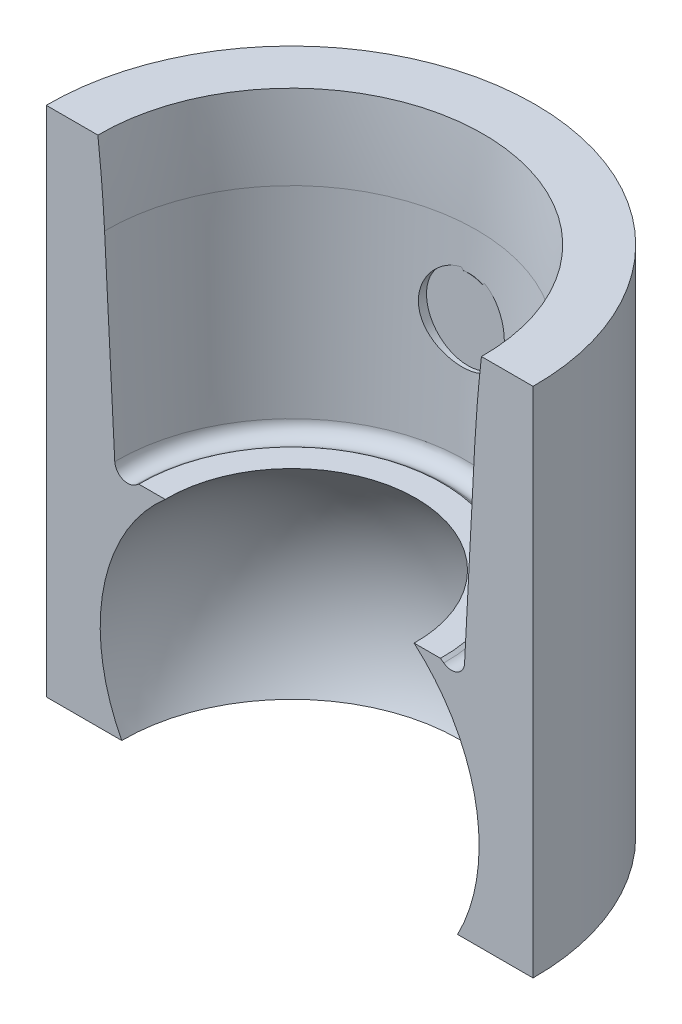
ISO-10303-21;
HEADER;
FILE_DESCRIPTION(('STEP AP214'),'2;1');
FILE_NAME('part.step','',(''),(''),'','','');
FILE_SCHEMA(('AUTOMOTIVE_DESIGN { 1 0 10303 214 1 1 1 1 }'));
ENDSEC;
DATA;
#1=APPLICATION_CONTEXT('core data for automotive mechanical design processes');
#2=APPLICATION_PROTOCOL_DEFINITION('international standard','automotive_design',2000,#1);
#3=PRODUCT_CONTEXT('',#1,'mechanical');
#4=PRODUCT('Part','Part','',(#3));
#5=PRODUCT_RELATED_PRODUCT_CATEGORY('part','',(#4));
#6=PRODUCT_DEFINITION_FORMATION('','',#4);
#7=PRODUCT_DEFINITION_CONTEXT('part definition',#1,'design');
#8=PRODUCT_DEFINITION('design','',#6,#7);
#9=PRODUCT_DEFINITION_SHAPE('','',#8);
#10=(LENGTH_UNIT() NAMED_UNIT(*) SI_UNIT(.MILLI.,.METRE.));
#11=(NAMED_UNIT(*) PLANE_ANGLE_UNIT() SI_UNIT($,.RADIAN.));
#12=(NAMED_UNIT(*) SI_UNIT($,.STERADIAN.) SOLID_ANGLE_UNIT());
#13=UNCERTAINTY_MEASURE_WITH_UNIT(LENGTH_MEASURE(1.E-05),#10,'distance_accuracy_value','');
#14=(GEOMETRIC_REPRESENTATION_CONTEXT(3) GLOBAL_UNCERTAINTY_ASSIGNED_CONTEXT((#13)) GLOBAL_UNIT_ASSIGNED_CONTEXT((#10,
#11,#12)) REPRESENTATION_CONTEXT('',''));
#15=CARTESIAN_POINT('',(0.,0.,0.));
#16=DIRECTION('',(0.,0.,1.));
#17=DIRECTION('',(1.,0.,0.));
#18=AXIS2_PLACEMENT_3D('',#15,#16,#17);
#19=CARTESIAN_POINT('',(-79.7256058125446,35.1264224483665,70.9150340188587));
#20=DIRECTION('',(0.0340598612356128,0.,0.999419794607157));
#21=DIRECTION('',(0.999419794607157,0.,-0.0340598612356128));
#22=AXIS2_PLACEMENT_3D('',#19,#20,#21);
#23=CYLINDRICAL_SURFACE('',#22,3.8862);
#24=CARTESIAN_POINT('',(-81.7677375661283,31.9086009144424,74.9691859949615));
#25=CARTESIAN_POINT('',(-81.5888086663685,31.7870084566757,74.9473227789427));
#26=CARTESIAN_POINT('',(-81.3995469542816,31.6803972746676,74.9258172586039));
#27=CARTESIAN_POINT('',(-81.0054898802874,31.500229822238,74.8858329320388));
#28=CARTESIAN_POINT('',(-80.8006851627524,31.4266936476995,74.8673559702405));
#29=CARTESIAN_POINT('',(-80.3812223129121,31.3149007902699,74.835225191827));
#30=CARTESIAN_POINT('',(-80.1665617848246,31.2766527335031,74.8215725550132));
#31=CARTESIAN_POINT('',(-79.733611100052,31.2366647347113,74.8001866517314));
#32=CARTESIAN_POINT('',(-79.5153216111935,31.2349181482583,74.7924523081928));
#33=CARTESIAN_POINT('',(-79.083170813506,31.2678314520266,74.7831919535085));
#34=CARTESIAN_POINT('',(-78.8692879243515,31.302195162723,74.7816159279515));
#35=CARTESIAN_POINT('',(-78.4501832271733,31.4058244412136,74.7839622395561));
#36=CARTESIAN_POINT('',(-78.2449619079217,31.4750919757833,74.7878848865815));
#37=CARTESIAN_POINT('',(-77.8482017405803,31.6467967664371,74.7999527797152));
#38=CARTESIAN_POINT('',(-77.656712638121,31.7493478467667,74.8081125744578));
#39=CARTESIAN_POINT('',(-77.2934252911492,31.9846750152973,74.8267916558901));
#40=CARTESIAN_POINT('',(-77.121628826949,32.1174538330008,74.8373111556551));
#41=CARTESIAN_POINT('',(-76.8004516038243,32.4114491301066,74.8586278666432));
#42=CARTESIAN_POINT('',(-76.6513723195131,32.5729950876464,74.8694269020583));
#43=CARTESIAN_POINT('',(-76.38246097456,32.9189576975818,74.8887875736911));
#44=CARTESIAN_POINT('',(-76.2626282291553,33.1033738143553,74.8973492622933));
#45=CARTESIAN_POINT('',(-76.056066776115,33.4893825740427,74.9100281066031));
#46=CARTESIAN_POINT('',(-75.9692450009104,33.6909249377274,74.9141578182541));
#47=CARTESIAN_POINT('',(-75.830909696943,34.1058058826224,74.9163450257342));
#48=CARTESIAN_POINT('',(-75.7793911508349,34.3191427829171,74.9144033846509));
#49=CARTESIAN_POINT('',(-75.7137934619049,34.7474331175279,74.9036547508926));
#50=CARTESIAN_POINT('',(-75.6990653759256,34.9622904824643,74.8949703517145));
#51=CARTESIAN_POINT('',(-75.705434496926,35.3910854219118,74.8709252589786));
#52=CARTESIAN_POINT('',(-75.7265311559046,35.6050230104424,74.8555646675473));
#53=CARTESIAN_POINT('',(-75.8035481023369,36.0253763298859,74.8191363493993));
#54=CARTESIAN_POINT('',(-75.8593701004569,36.2318115564674,74.798084825516));
#55=CARTESIAN_POINT('',(-76.003894502988,36.6323431202198,74.7518937856395));
#56=CARTESIAN_POINT('',(-76.0926013948651,36.8264377691612,74.7267537119864));
#57=CARTESIAN_POINT('',(-76.3026774468737,37.2015895083074,74.6739435475116));
#58=CARTESIAN_POINT('',(-76.4247417524266,37.3822510720483,74.6462290077816));
#59=CARTESIAN_POINT('',(-76.6972096214041,37.7208898175392,74.5913765277081));
#60=CARTESIAN_POINT('',(-76.8476171149578,37.8788638480264,74.5642386679098));
#61=CARTESIAN_POINT('',(-77.1758485894993,38.1706127982458,74.5127493140419));
#62=CARTESIAN_POINT('',(-77.3541256768495,38.3038895672149,74.4884582016627));
#63=CARTESIAN_POINT('',(-77.7311700948425,38.5386574093305,74.4459185870138));
#64=CARTESIAN_POINT('',(-77.9299355568616,38.6401513777952,74.4276695343218));
#65=CARTESIAN_POINT('',(-78.3394068335703,38.8069012249213,74.3996396446877));
#66=CARTESIAN_POINT('',(-78.5499032985727,38.872650683458,74.3897423665107));
#67=CARTESIAN_POINT('',(-78.9791692915535,38.9678196959596,74.3794438258913));
#68=CARTESIAN_POINT('',(-79.197937025862,38.99724708052,74.3790405163264));
#69=CARTESIAN_POINT('',(-79.6304435176778,39.0184001639013,74.3881429886285));
#70=CARTESIAN_POINT('',(-79.844134954855,39.0112361668352,74.3973502821376));
#71=CARTESIAN_POINT('',(-80.2668502462944,38.9620117219058,74.4248184689309));
#72=CARTESIAN_POINT('',(-80.4758743075481,38.9199528247511,74.4430789598818));
#73=CARTESIAN_POINT('',(-80.8819887658854,38.8027625881446,74.487257902345));
#74=CARTESIAN_POINT('',(-81.0791507602907,38.7278585069397,74.5131233364643));
#75=CARTESIAN_POINT('',(-81.4579520455932,38.5473481337684,74.570668446847));
#76=CARTESIAN_POINT('',(-81.6395893027354,38.4417378272101,74.6023488831752));
#77=CARTESIAN_POINT('',(-81.9871429319837,38.1998164355347,74.6700073296976));
#78=CARTESIAN_POINT('',(-82.1525566090881,38.0628077907163,74.7060725564652));
#79=CARTESIAN_POINT('',(-82.4583100591468,37.763372835557,74.7790504985755));
#80=CARTESIAN_POINT('',(-82.5986454828513,37.6009421254846,74.8159633596707));
#81=CARTESIAN_POINT('',(-82.8539473564246,37.2503957356587,74.888697952217));
#82=CARTESIAN_POINT('',(-82.9681755948624,37.061730683272,74.9244678527496));
#83=CARTESIAN_POINT('',(-83.163350075752,36.6670785096278,74.990986463391));
#84=CARTESIAN_POINT('',(-83.2442974296569,36.4610919671179,75.0217353411618));
#85=CARTESIAN_POINT('',(-83.3700387817374,36.0386192190134,75.075607335166));
#86=CARTESIAN_POINT('',(-83.4150255514756,35.8221956834957,75.0987707139994));
#87=CARTESIAN_POINT('',(-83.4679316030642,35.3841100821037,75.1359979864793));
#88=CARTESIAN_POINT('',(-83.4758584627034,35.162449096469,75.150063739847));
#89=CARTESIAN_POINT('',(-83.4544563597272,34.7262908986379,75.1681539030849));
#90=CARTESIAN_POINT('',(-83.4260851629806,34.5117566217292,75.1724284825734));
#91=CARTESIAN_POINT('',(-83.3344318669467,34.0902654762228,75.1720238761969));
#92=CARTESIAN_POINT('',(-83.2711464511165,33.8833093294725,75.1673438396182));
#93=CARTESIAN_POINT('',(-83.1121629483939,33.4846181028635,75.1503759014057));
#94=CARTESIAN_POINT('',(-83.0167385294464,33.2927708456885,75.138151532466));
#95=CARTESIAN_POINT('',(-82.7960591813308,32.927683726872,75.1080940656635));
#96=CARTESIAN_POINT('',(-82.6708208557955,32.7544335859714,75.0902640878487));
#97=CARTESIAN_POINT('',(-82.4207604654488,32.4623666526242,75.0551240384613));
#98=CARTESIAN_POINT('',(-82.300542144944,32.33950259379,75.0383803070487));
#99=CARTESIAN_POINT('',(-82.0449603339447,32.110820070039,75.0040781199892));
#100=CARTESIAN_POINT('',(-81.9095963832744,32.0050021232792,74.9865196395969));
#101=CARTESIAN_POINT('',(-81.7677375661283,31.9086009144424,74.9691859949615));
#102=B_SPLINE_CURVE_WITH_KNOTS('',3,(#24,#25,#26,#27,#28,#29,#30,#31,#32,#33,#34,#35,#36,#37,
#38,#39,#40,#41,#42,#43,#44,#45,#46,#47,#48,#49,#50,#51,#52,#53,#54,#55,#56,#57,#58,#59,#60,#61,
#62,#63,#64,#65,#66,#67,#68,#69,#70,#71,#72,#73,#74,#75,#76,#77,#78,#79,#80,#81,#82,#83,#84,#85,
#86,#87,#88,#89,#90,#91,#92,#93,#94,#95,#96,#97,#98,#99,#100,#101),.UNSPECIFIED.,.T.,.F.,(4,2,2,
2,2,2,2,2,2,2,2,2,2,2,2,2,2,2,2,2,2,2,2,2,2,2,2,2,2,2,2,2,2,2,2,2,2,2,4),(0.,0.651696577554053,
1.30378858313845,1.95603994937497,2.60817258409509,3.25499781764965,3.90185950286305,
4.55095707873766,5.20011329005073,5.85724852683873,6.5143683763378,7.16962162799851,
7.82478173481003,8.46830124499731,9.1118109115382,9.75350737377767,10.3952914340368,
11.0516310322097,11.7080617069394,12.3765576567847,13.0449926909188,13.7039466833969,
14.362758588616,15.0017009253104,15.6406148693104,16.275176206866,16.9098205455414,
17.5602323574334,18.2107568591507,18.8778707254409,19.5449623108942,20.2084534195589,
20.8718088555951,21.5180165577606,22.1642856545281,22.8051852515221,23.4457287573229,
23.9623926174669,24.4790721798746),.UNSPECIFIED.);
#103=CARTESIAN_POINT('',(-78.1662720702075,38.7362498068561,74.4115240442107));
#104=VERTEX_POINT('',#103);
#105=CARTESIAN_POINT('',(-80.0622345212644,38.9858328837169,74.4115240442107));
#106=VERTEX_POINT('',#105);
#107=EDGE_CURVE('E134',#104,#106,#102,.T.);
#108=ORIENTED_EDGE('',*,*,#107,.T.);
#109=CARTESIAN_POINT('',(-79.606446710716,35.1264224483665,74.4115240442107));
#110=DIRECTION('',(0.,0.,1.));
#111=DIRECTION('',(1.,0.,0.));
#112=AXIS2_PLACEMENT_3D('',#109,#110,#111);
#113=ELLIPSE('',#112,3.88845610320091,3.8862);
#114=EDGE_CURVE('E132',#106,#104,#113,.F.);
#115=ORIENTED_EDGE('',*,*,#114,.T.);
#116=EDGE_LOOP('',(#108,#115));
#117=FACE_BOUND('',#116,.T.);
#118=ADVANCED_FACE('F34',(#117),#23,.T.);
#119=CARTESIAN_POINT('',(-78.989108214344,1.70423955265499,92.5261108588515));
#120=DIRECTION('',(0.,1.,0.));
#121=DIRECTION('',(0.0340598612356128,0.,0.999419794607157));
#122=AXIS2_PLACEMENT_3D('',#119,#120,#121);
#123=CONICAL_SURFACE('',#122,16.1925,0.05235987755983);
#124=CARTESIAN_POINT('',(-60.638602471747,42.8990224483665,92.71));
#125=CARTESIAN_POINT('',(-60.807155535694,39.6829996001166,92.71));
#126=CARTESIAN_POINT('',(-60.9757088527177,36.4669767651306,92.71));
#127=CARTESIAN_POINT('',(-61.3128159929188,30.0349311216864,92.71));
#128=CARTESIAN_POINT('',(-61.4813698160962,26.8189083132282,92.71));
#129=CARTESIAN_POINT('',(-61.6499238923504,23.602885518034,92.71));
#130=B_SPLINE_CURVE_WITH_KNOTS('',3,(#124,#125,#126,#127,#128,#129),.UNSPECIFIED.,.F.,.F.,(4,2,
4),(0.,9.66131035949466,19.3226207189893),.UNSPECIFIED.);
#131=CARTESIAN_POINT('',(-60.6386129538292,42.8988224483665,92.71));
#132=VERTEX_POINT('',#131);
#133=CARTESIAN_POINT('',(-61.6499134102051,23.603085518034,92.71));
#134=VERTEX_POINT('',#133);
#135=EDGE_CURVE('E226',#132,#134,#130,.T.);
#136=ORIENTED_EDGE('',*,*,#135,.F.);
#137=CARTESIAN_POINT('',(-78.989108214344,42.8988224483665,92.5261108588515));
#138=DIRECTION('',(0.,-1.,0.));
#139=DIRECTION('',(-0.0340598612356128,0.,-0.999419794607157));
#140=AXIS2_PLACEMENT_3D('',#137,#138,#139);
#141=CIRCLE('',#140,18.3514166080554);
#142=CARTESIAN_POINT('',(-97.3396034748589,42.8988224483665,92.71));
#143=VERTEX_POINT('',#142);
#144=EDGE_CURVE('E178',#143,#132,#141,.T.);
#145=ORIENTED_EDGE('',*,*,#144,.F.);
#146=CARTESIAN_POINT('',(-96.3282925363377,23.602885518034,92.71));
#147=CARTESIAN_POINT('',(-96.4968466125918,26.8189083132282,92.71));
#148=CARTESIAN_POINT('',(-96.6654004357692,30.0349311216864,92.71));
#149=CARTESIAN_POINT('',(-97.0025075759703,36.4669767651306,92.71));
#150=CARTESIAN_POINT('',(-97.171060892994,39.6829996001166,92.71));
#151=CARTESIAN_POINT('',(-97.339613956941,42.8990224483665,92.71));
#152=B_SPLINE_CURVE_WITH_KNOTS('',3,(#146,#147,#148,#149,#150,#151),.UNSPECIFIED.,.F.,.F.,(4,2,
4),(0.,9.66131035949467,19.3226207189893),.UNSPECIFIED.);
#153=CARTESIAN_POINT('',(-96.328303018483,23.603085518034,92.71));
#154=VERTEX_POINT('',#153);
#155=EDGE_CURVE('E220',#154,#143,#152,.T.);
#156=ORIENTED_EDGE('',*,*,#155,.F.);
#157=CARTESIAN_POINT('',(-78.989108214344,23.603085518034,92.5261108588515));
#158=DIRECTION('',(0.,1.,0.));
#159=DIRECTION('',(0.0340598612356128,0.,0.999419794607157));
#160=AXIS2_PLACEMENT_3D('',#157,#158,#159);
#161=CIRCLE('',#160,17.3401698859069);
#162=EDGE_CURVE('E189',#134,#154,#161,.T.);
#163=ORIENTED_EDGE('',*,*,#162,.F.);
#164=EDGE_LOOP('',(#136,#145,#156,#163));
#165=FACE_BOUND('',#164,.T.);
#166=CARTESIAN_POINT('',(-80.2455281388927,39.2140607245614,74.4113240442107));
#167=CARTESIAN_POINT('',(-80.3595111780865,39.1962925564262,74.4201536633559));
#168=CARTESIAN_POINT('',(-80.4726300401191,39.1737165418166,74.4302769945168));
#169=CARTESIAN_POINT('',(-80.6963260208541,39.1192266209097,74.4528828342059));
#170=CARTESIAN_POINT('',(-80.8069037766738,39.0873150834241,74.4653647439801));
#171=CARTESIAN_POINT('',(-81.0245422211141,39.0144964180067,74.4924367688122));
#172=CARTESIAN_POINT('',(-81.1316095767474,38.9736076322145,74.5070225647035));
#173=CARTESIAN_POINT('',(-81.3417149909851,38.8831669837913,74.5380274946462));
#174=CARTESIAN_POINT('',(-81.4447528804185,38.8336147579157,74.5544467055594));
#175=CARTESIAN_POINT('',(-81.7466920166131,38.6725686547797,74.6059682550359));
#176=CARTESIAN_POINT('',(-81.938723996258,38.548582533149,74.6433736929284));
#177=CARTESIAN_POINT('',(-82.2992042309002,38.2709911214933,74.7213646017834));
#178=CARTESIAN_POINT('',(-82.4676435797755,38.1173746978887,74.7619512646767));
#179=CARTESIAN_POINT('',(-82.7807302789077,37.7802955977148,74.8441634096307));
#180=CARTESIAN_POINT('',(-82.9246849026543,37.5961878451071,74.8857897195972));
#181=CARTESIAN_POINT('',(-83.1796262495493,37.2057193089764,74.9656405556373));
#182=CARTESIAN_POINT('',(-83.2906112659191,36.999357374147,75.0038649055257));
#183=CARTESIAN_POINT('',(-83.4763443846481,36.5695087343111,75.0737616556108));
#184=CARTESIAN_POINT('',(-83.5510441696311,36.3459996519896,75.1054252875843));
#185=CARTESIAN_POINT('',(-83.6612585926114,35.8884584257408,75.1594867216038));
#186=CARTESIAN_POINT('',(-83.696784805604,35.6544294115231,75.1818872594828));
#187=CARTESIAN_POINT('',(-83.7265753587704,35.1911633489802,75.2151718000457));
#188=CARTESIAN_POINT('',(-83.7222302819936,34.9620422760097,75.2264288580766));
#189=CARTESIAN_POINT('',(-83.6754653170444,34.5074517508835,75.238384954387));
#190=CARTESIAN_POINT('',(-83.6330500586792,34.2819818580934,75.2390852763125));
#191=CARTESIAN_POINT('',(-83.5128304042838,33.8465666253052,75.2308306877923));
#192=CARTESIAN_POINT('',(-83.4358731009475,33.6363820359001,75.2221002350324));
#193=CARTESIAN_POINT('',(-83.2491304113227,33.231642100087,75.1970271041028));
#194=CARTESIAN_POINT('',(-83.1393422190349,33.0370880914013,75.1806837752071));
#195=CARTESIAN_POINT('',(-82.8881031346217,32.6657924222201,75.1424172039438));
#196=CARTESIAN_POINT('',(-82.7461864361069,32.4893747860887,75.1204111460548));
#197=CARTESIAN_POINT('',(-82.4355643076333,32.1623547685257,75.0737230991911));
#198=CARTESIAN_POINT('',(-82.2668547975494,32.0117563262279,75.0490407028338));
#199=CARTESIAN_POINT('',(-81.9023662070699,31.7366987372548,74.9991685172382));
#200=CARTESIAN_POINT('',(-81.7060003986814,31.6130153979363,74.9739820932975));
#201=CARTESIAN_POINT('',(-81.2949850822626,31.4003070167931,74.9265163624158));
#202=CARTESIAN_POINT('',(-81.0803355886942,31.311281947555,74.9042370531755));
#203=CARTESIAN_POINT('',(-80.6384657637884,31.1704948907904,74.8648114232527));
#204=CARTESIAN_POINT('',(-80.411234594738,31.1187655845092,74.8476696120832));
#205=CARTESIAN_POINT('',(-79.9509106014608,31.0544227802464,74.8200384089593));
#206=CARTESIAN_POINT('',(-79.7178184520172,31.0418047999219,74.8095482548032));
#207=CARTESIAN_POINT('',(-79.256577012534,31.0560821748752,74.79588702246));
#208=CARTESIAN_POINT('',(-79.0284105913841,31.0823156357793,74.7925956537579));
#209=CARTESIAN_POINT('',(-78.5796305885342,31.1723823126931,74.7925581505512));
#210=CARTESIAN_POINT('',(-78.3590168851193,31.2362149224758,74.7958119105186));
#211=CARTESIAN_POINT('',(-77.9325738371393,31.3992511216288,74.8075563534686));
#212=CARTESIAN_POINT('',(-77.7266828145991,31.4982953274237,74.8160235624121));
#213=CARTESIAN_POINT('',(-77.33423750307,31.7289973605775,74.8362301327875));
#214=CARTESIAN_POINT('',(-77.1476847773508,31.8606578216581,74.8479697584724));
#215=CARTESIAN_POINT('',(-76.796919188053,32.1546876695885,74.8724816852092));
#216=CARTESIAN_POINT('',(-76.6329916709436,32.3173967054734,74.8852644169875));
#217=CARTESIAN_POINT('',(-76.3346075264475,32.6680262729893,74.9091048906884));
#218=CARTESIAN_POINT('',(-76.2001516819231,32.8559474741226,74.9201625867862));
#219=CARTESIAN_POINT('',(-75.9640739256721,33.2525598316526,74.9380886555452));
#220=CARTESIAN_POINT('',(-75.8625776717784,33.4613265986617,74.9449410819785));
#221=CARTESIAN_POINT('',(-75.6961220584896,33.8930456867707,74.9523343907855));
#222=CARTESIAN_POINT('',(-75.6311580616796,34.11599620338,74.9528760744189));
#223=CARTESIAN_POINT('',(-75.5402618952524,34.5665901701096,74.9464237142159));
#224=CARTESIAN_POINT('',(-75.5138335819166,34.7941350152181,74.939527484655));
#225=CARTESIAN_POINT('',(-75.4990664291414,35.2500970870838,74.9180905078289));
#226=CARTESIAN_POINT('',(-75.5107281132079,35.478514325788,74.903549655499));
#227=CARTESIAN_POINT('',(-75.5714117583362,35.9285349375985,74.8676593654838));
#228=CARTESIAN_POINT('',(-75.6202388431702,36.1501676004288,74.8463457790042));
#229=CARTESIAN_POINT('',(-75.7534111712403,36.5818798904205,74.798492282104));
#230=CARTESIAN_POINT('',(-75.8377571886891,36.7919592656399,74.7719522577686));
#231=CARTESIAN_POINT('',(-76.0412818961589,37.1986737400192,74.7154133923176));
#232=CARTESIAN_POINT('',(-76.161047234721,37.3950073284907,74.6853619192094));
#233=CARTESIAN_POINT('',(-76.4316826266486,37.7650643583498,74.6249760240241));
#234=CARTESIAN_POINT('',(-76.5825579889913,37.9387839323532,74.5946415544979));
#235=CARTESIAN_POINT('',(-76.8354252069491,38.1849671984721,74.5500685425028));
#236=CARTESIAN_POINT('',(-76.9279253811056,38.2672150754914,74.5348515954885));
#237=CARTESIAN_POINT('',(-77.1201139390299,38.4231453483846,74.5056566927975));
#238=CARTESIAN_POINT('',(-77.2198026026188,38.4968274105312,74.4916787853992));
#239=CARTESIAN_POINT('',(-77.42577548287,38.6350953885847,74.4653844503951));
#240=CARTESIAN_POINT('',(-77.5320716613216,38.6996640721173,74.4530711722212));
#241=CARTESIAN_POINT('',(-77.7502619894614,38.8190035594535,74.4305318351189));
#242=CARTESIAN_POINT('',(-77.8621571401962,38.873772603101,74.420306151106));
#243=CARTESIAN_POINT('',(-77.9764177326349,38.9233609094516,74.4113240442107));
#244=B_SPLINE_CURVE_WITH_KNOTS('',3,(#166,#167,#168,#169,#170,#171,#172,#173,#174,#175,#176,
#177,#178,#179,#180,#181,#182,#183,#184,#185,#186,#187,#188,#189,#190,#191,#192,#193,#194,#195,
#196,#197,#198,#199,#200,#201,#202,#203,#204,#205,#206,#207,#208,#209,#210,#211,#212,#213,#214,
#215,#216,#217,#218,#219,#220,#221,#222,#223,#224,#225,#226,#227,#228,#229,#230,#231,#232,#233,
#234,#235,#236,#237,#238,#239,#240,#241,#242,#243),.UNSPECIFIED.,.F.,.F.,(4,2,2,2,2,2,2,2,2,2,2,
2,2,2,2,2,2,2,2,2,2,2,2,2,2,2,2,2,2,2,2,2,2,2,2,2,2,2,4),(0.,0.346959515303257,
0.693831068750144,1.04000038932805,1.38618422773112,2.07759055298041,2.76925718189489,
3.4780575178377,4.18689454073629,4.89667288024911,5.60624143842806,6.29115920036566,
6.97599367907493,7.64488069745541,8.31382490079602,8.99317115017407,9.67262095270809,
10.3696239831848,11.066626462357,11.764238965647,12.461771516288,13.1475564038909,
13.8333302345977,14.5160386588817,15.1988022289947,15.8895140503499,16.5802442170075,
17.2735776792657,17.966823109703,18.6510617539227,19.3353098023033,20.0159945131735,
20.6966940618209,21.3893679523025,22.0821601467103,22.4558610182903,22.8295764445186,
23.2039893197492,23.5784693775509),.UNSPECIFIED.);
#245=CARTESIAN_POINT('',(-80.2481040528897,39.2136580600531,74.4115240442107));
#246=VERTEX_POINT('',#245);
#247=CARTESIAN_POINT('',(-77.9738791180568,38.9222577921625,74.4115240442107));
#248=VERTEX_POINT('',#247);
#249=EDGE_CURVE('E137',#246,#248,#244,.T.);
#250=ORIENTED_EDGE('',*,*,#249,.F.);
#251=CARTESIAN_POINT('',(-82.8479824247615,46.1355547267881,74.4115240442107));
#252=CARTESIAN_POINT('',(-82.7563351952133,45.7716621545112,74.4115240442107));
#253=CARTESIAN_POINT('',(-82.6619548262475,45.408422504095,74.4115240442107));
#254=CARTESIAN_POINT('',(-82.4658044694869,44.6835421999464,74.4115240442107));
#255=CARTESIAN_POINT('',(-82.364026843307,44.3219036201628,74.4115240442107));
#256=CARTESIAN_POINT('',(-82.1504500448492,43.5982583155567,74.4115240442107));
#257=CARTESIAN_POINT('',(-82.038573895996,43.236273999756,74.4115240442107));
#258=CARTESIAN_POINT('',(-81.8024527631383,42.5165555324594,74.4115240442107));
#259=CARTESIAN_POINT('',(-81.6782140961791,42.1588193138006,74.4115240442107));
#260=CARTESIAN_POINT('',(-81.4054329464268,41.4311488504694,74.4115240442107));
#261=CARTESIAN_POINT('',(-81.25596225169,41.061548407396,74.4115240442107));
#262=CARTESIAN_POINT('',(-81.0083446576694,40.5171945000443,74.4115240442107));
#263=CARTESIAN_POINT('',(-80.9217815705949,40.3372006574441,74.4115240442107));
#264=CARTESIAN_POINT('',(-80.7380784850728,39.9827466612111,74.4115240442107));
#265=CARTESIAN_POINT('',(-80.6409482336772,39.8082815965455,74.4115240442107));
#266=CARTESIAN_POINT('',(-80.4327398905549,39.4701150832399,74.4115240442107));
#267=CARTESIAN_POINT('',(-80.3218009647344,39.3063281222455,74.4115240442107));
#268=CARTESIAN_POINT('',(-80.0782421902425,38.9961827791987,74.4115240442107));
#269=CARTESIAN_POINT('',(-79.9458164825699,38.8496869472483,74.4115240442107));
#270=CARTESIAN_POINT('',(-79.7446822983331,38.679038775135,74.4115240442107));
#271=CARTESIAN_POINT('',(-79.690957577923,38.6375414071897,74.4115240442107));
#272=CARTESIAN_POINT('',(-79.5787734193073,38.5612533928258,74.4115240442107));
#273=CARTESIAN_POINT('',(-79.5203097663235,38.5264688117552,74.4115240442107));
#274=CARTESIAN_POINT('',(-79.3977894232894,38.4658022083535,74.4115240442107));
#275=CARTESIAN_POINT('',(-79.33366693761,38.4400490357795,74.4115240442107));
#276=CARTESIAN_POINT('',(-79.2017035983951,38.401373646653,74.4115240442107));
#277=CARTESIAN_POINT('',(-79.1338742940759,38.3884137347989,74.4115240442107));
#278=CARTESIAN_POINT('',(-79.0041294502755,38.3779782169456,74.4115240442107));
#279=CARTESIAN_POINT('',(-78.9423336966667,38.3790305852561,74.4115240442107));
#280=CARTESIAN_POINT('',(-78.820051268791,38.3929180710014,74.4115240442107));
#281=CARTESIAN_POINT('',(-78.7595664109216,38.405768585635,74.4115240442107));
#282=CARTESIAN_POINT('',(-78.6321726838486,38.4444590824473,74.4115240442107));
#283=CARTESIAN_POINT('',(-78.5658151279899,38.4720692106852,74.4115240442107));
#284=CARTESIAN_POINT('',(-78.4383588882015,38.5374127289913,74.4115240442107));
#285=CARTESIAN_POINT('',(-78.3772691259111,38.5751628641735,74.4115240442107));
#286=CARTESIAN_POINT('',(-78.2158217515395,38.6890383061807,74.4115240442107));
#287=CARTESIAN_POINT('',(-78.1207735976982,38.7725711298843,74.4115240442107));
#288=CARTESIAN_POINT('',(-77.942882156432,38.9517192549901,74.4115240442107));
#289=CARTESIAN_POINT('',(-77.8600867962086,39.0473794196074,74.4115240442107));
#290=CARTESIAN_POINT('',(-77.6547576516487,39.3078060412454,74.4115240442107));
#291=CARTESIAN_POINT('',(-77.5397183094578,39.4784053703551,74.4115240442107));
#292=CARTESIAN_POINT('',(-77.3250975837199,39.8291988514051,74.4115240442107));
#293=CARTESIAN_POINT('',(-77.2255563338481,40.0094163433311,74.4115240442107));
#294=CARTESIAN_POINT('',(-77.0364401412549,40.3775421747923,74.4115240442107));
#295=CARTESIAN_POINT('',(-76.9469904334379,40.5655143808482,74.4115240442107));
#296=CARTESIAN_POINT('',(-76.7765467507137,40.9448905386619,74.4115240442107));
#297=CARTESIAN_POINT('',(-76.695541538777,41.1362895222664,74.4115240442107));
#298=CARTESIAN_POINT('',(-76.5220372491891,41.5660020515217,74.4115240442107));
#299=CARTESIAN_POINT('',(-76.4311826238095,41.80497636556,74.4115240442107));
#300=CARTESIAN_POINT('',(-76.256865381064,42.2856193482502,74.4115240442107));
#301=CARTESIAN_POINT('',(-76.1734039829626,42.5272884539459,74.4115240442107));
#302=CARTESIAN_POINT('',(-75.9316416138993,43.2554475028425,74.4115240442107));
#303=CARTESIAN_POINT('',(-75.7820635889811,43.7448272203344,74.4115240442107));
#304=CARTESIAN_POINT('',(-75.4982007750472,44.729673217768,74.4115240442107));
#305=CARTESIAN_POINT('',(-75.3639689127009,45.2251543983327,74.4115240442107));
#306=CARTESIAN_POINT('',(-75.1072735232405,46.2189652114649,74.4115240442107));
#307=CARTESIAN_POINT('',(-74.9848060990824,46.7172938424392,74.4115240442107));
#308=CARTESIAN_POINT('',(-74.7614223269712,47.6631325139962,74.4115240442107));
#309=CARTESIAN_POINT('',(-74.6595976227043,48.110429933355,74.4115240442107));
#310=CARTESIAN_POINT('',(-74.4618711524387,49.0063773149147,74.4115240442107));
#311=CARTESIAN_POINT('',(-74.3659700016007,49.4550274125339,74.4115240442107));
#312=CARTESIAN_POINT('',(-74.17973246323,50.3504297545002,74.4115240442107));
#313=CARTESIAN_POINT('',(-74.0893639112314,50.7971753380651,74.4115240442107));
#314=CARTESIAN_POINT('',(-73.9128467969792,51.6914276995685,74.4115240442107));
#315=CARTESIAN_POINT('',(-73.8266975745624,52.1389343470194,74.4115240442107));
#316=CARTESIAN_POINT('',(-73.7423078863117,52.5867657382959,74.4115240442107));
#317=B_SPLINE_CURVE_WITH_KNOTS('',3,(#251,#252,#253,#254,#255,#256,#257,#258,#259,#260,#261,
#262,#263,#264,#265,#266,#267,#268,#269,#270,#271,#272,#273,#274,#275,#276,#277,#278,#279,#280,
#281,#282,#283,#284,#285,#286,#287,#288,#289,#290,#291,#292,#293,#294,#295,#296,#297,#298,#299,
#300,#301,#302,#303,#304,#305,#306,#307,#308,#309,#310,#311,#312,#313,#314,#315,#316),
.UNSPECIFIED.,.F.,.F.,(4,2,2,2,2,2,2,2,2,2,2,2,2,2,2,2,2,2,2,2,2,2,2,2,2,2,2,2,2,2,2,2,4),(0.,
1.12580624044443,2.25279196936395,3.38924126228555,4.5251128014265,5.72008508454918,
6.31905899767257,6.91748503348909,7.51030583234928,8.09804144141528,8.30132158522666,
8.50478455183871,8.7110423091983,8.91669049836166,9.10092180741112,9.28539389025861,
9.49981530306578,9.71459300985278,10.0920695336193,10.4709856131211,11.0866589686954,
11.7039010571495,12.3281131914641,12.9514837935173,13.7182989338081,14.4852402999892,
16.019964409163,17.5598313217798,19.0991863720049,20.475364977316,21.8516862592673,
23.2190470018095,24.5861931169128),.UNSPECIFIED.);
#318=EDGE_CURVE('E121',#246,#106,#317,.T.);
#319=ORIENTED_EDGE('',*,*,#318,.T.);
#320=ORIENTED_EDGE('',*,*,#107,.F.);
#321=EDGE_CURVE('E142',#104,#248,#317,.T.);
#322=ORIENTED_EDGE('',*,*,#321,.T.);
#323=EDGE_LOOP('',(#250,#319,#320,#322));
#324=FACE_BOUND('',#323,.T.);
#325=ADVANCED_FACE('F151',(#165,#324),#123,.F.);
#326=CARTESIAN_POINT('',(-78.989108214344,8.70131498436996,92.5261108588516));
#327=DIRECTION('',(0.,1.,0.));
#328=DIRECTION('',(0.979687696480223,0.,0.200529342903411));
#329=AXIS2_PLACEMENT_3D('',#326,#327,#328);
#330=SPHERICAL_SURFACE('',#329,18.7833);
#331=CARTESIAN_POINT('',(-78.989108214344,0.,92.5261108588516));
#332=DIRECTION('',(0.,1.,0.));
#333=DIRECTION('',(0.,0.,1.));
#334=AXIS2_PLACEMENT_3D('',#331,#332,#333);
#335=CIRCLE('',#334,16.646305188623);
#336=CARTESIAN_POINT('',(-62.3438187540629,0.,92.71));
#337=VERTEX_POINT('',#336);
#338=CARTESIAN_POINT('',(-95.6343976746251,0.,92.71));
#339=VERTEX_POINT('',#338);
#340=EDGE_CURVE('E192',#337,#339,#335,.T.);
#341=ORIENTED_EDGE('',*,*,#340,.F.);
#342=CARTESIAN_POINT('',(-78.989108214344,8.70131498436996,92.71));
#343=DIRECTION('',(0.,0.,-1.));
#344=DIRECTION('',(-1.,0.,0.));
#345=AXIS2_PLACEMENT_3D('',#342,#343,#344);
#346=CIRCLE('',#345,18.7823998379804);
#347=CARTESIAN_POINT('',(-66.6477070660975,22.86,92.71));
#348=VERTEX_POINT('',#347);
#349=EDGE_CURVE('E219',#337,#348,#346,.F.);
#350=ORIENTED_EDGE('',*,*,#349,.T.);
#351=CARTESIAN_POINT('',(-78.989108214344,22.86,92.5261108588516));
#352=DIRECTION('',(0.,1.,0.));
#353=DIRECTION('',(0.,0.,1.));
#354=AXIS2_PLACEMENT_3D('',#351,#352,#353);
#355=CIRCLE('',#354,12.342771063184);
#356=CARTESIAN_POINT('',(-91.3305093625905,22.86,92.71));
#357=VERTEX_POINT('',#356);
#358=EDGE_CURVE('E131',#357,#348,#355,.F.);
#359=ORIENTED_EDGE('',*,*,#358,.F.);
#360=EDGE_CURVE('E49',#357,#339,#346,.F.);
#361=ORIENTED_EDGE('',*,*,#360,.T.);
#362=EDGE_LOOP('',(#341,#350,#359,#361));
#363=FACE_BOUND('',#362,.T.);
#364=ADVANCED_FACE('F279',(#363),#330,.F.);
#365=CARTESIAN_POINT('',(-78.989108214344,1.70423955265499,92.5261108588515));
#366=DIRECTION('',(-0.651237455569875,0.,-0.758874018835061));
#367=DIRECTION('',(-0.758874018835061,0.,0.651237455569875));
#368=AXIS2_PLACEMENT_3D('',#365,#366,#367);
#369=SPHERICAL_SURFACE('',#368,25.908);
#370=CARTESIAN_POINT('',(-78.989108214344,22.6248509460799,92.5261108588515));
#371=DIRECTION('',(0.,-1.,0.));
#372=DIRECTION('',(-0.0340598612356128,0.,-0.999419794607157));
#373=AXIS2_PLACEMENT_3D('',#370,#371,#372);
#374=CIRCLE('',#373,15.2824239872246);
#375=CARTESIAN_POINT('',(-94.2704258181721,22.6248509460799,92.71));
#376=VERTEX_POINT('',#375);
#377=CARTESIAN_POINT('',(-63.7077906105159,22.6248509460799,92.71));
#378=VERTEX_POINT('',#377);
#379=EDGE_CURVE('E128',#376,#378,#374,.T.);
#380=ORIENTED_EDGE('',*,*,#379,.F.);
#381=CARTESIAN_POINT('',(-78.989108214344,1.70423955265499,92.71));
#382=DIRECTION('',(0.,0.,-1.));
#383=DIRECTION('',(-1.,0.,0.));
#384=AXIS2_PLACEMENT_3D('',#381,#382,#383);
#385=CIRCLE('',#384,25.9073473899542);
#386=CARTESIAN_POINT('',(-93.9431862092697,22.86,92.71));
#387=VERTEX_POINT('',#386);
#388=EDGE_CURVE('E115',#376,#387,#385,.T.);
#389=ORIENTED_EDGE('',*,*,#388,.T.);
#390=CARTESIAN_POINT('',(-78.989108214344,22.86,92.5261108588515));
#391=DIRECTION('',(0.,1.,0.));
#392=DIRECTION('',(0.,0.,1.));
#393=AXIS2_PLACEMENT_3D('',#390,#391,#392);
#394=CIRCLE('',#393,14.9552085874638);
#395=CARTESIAN_POINT('',(-64.0350302194184,22.86,92.71));
#396=VERTEX_POINT('',#395);
#397=EDGE_CURVE('E126',#396,#387,#394,.T.);
#398=ORIENTED_EDGE('',*,*,#397,.F.);
#399=EDGE_CURVE('E56',#396,#378,#385,.T.);
#400=ORIENTED_EDGE('',*,*,#399,.T.);
#401=EDGE_LOOP('',(#380,#389,#398,#400));
#402=FACE_BOUND('',#401,.T.);
#403=ADVANCED_FACE('F125',(#402),#369,.T.);
#404=CARTESIAN_POINT('',(-78.989108214343,50.8,92.5261108588505));
#405=DIRECTION('',(0.,-1.,0.));
#406=DIRECTION('',(0.,0.,-1.));
#407=AXIS2_PLACEMENT_3D('',#404,#405,#406);
#408=CYLINDRICAL_SURFACE('',#407,24.13);
#409=CARTESIAN_POINT('',(-78.989108214343,50.8,92.5261108588505));
#410=DIRECTION('',(0.,1.,0.));
#411=DIRECTION('',(0.,0.,1.));
#412=AXIS2_PLACEMENT_3D('',#409,#410,#411);
#413=CIRCLE('',#412,24.13);
#414=CARTESIAN_POINT('',(-54.8598089127933,50.8,92.71));
#415=VERTEX_POINT('',#414);
#416=CARTESIAN_POINT('',(-103.118407515893,50.8,92.71));
#417=VERTEX_POINT('',#416);
#418=EDGE_CURVE('E150',#415,#417,#413,.T.);
#419=ORIENTED_EDGE('',*,*,#418,.F.);
#420=DIRECTION('',(0.,-1.,0.));
#421=VECTOR('',#420,1.);
#422=CARTESIAN_POINT('',(-54.8598089127933,50.8,92.71));
#423=LINE('',#422,#421);
#424=CARTESIAN_POINT('',(-54.8598089127933,0.,92.71));
#425=VERTEX_POINT('',#424);
#426=EDGE_CURVE('E228',#415,#425,#423,.T.);
#427=ORIENTED_EDGE('',*,*,#426,.T.);
#428=CARTESIAN_POINT('',(-78.989108214343,0.,92.5261108588505));
#429=DIRECTION('',(0.,1.,0.));
#430=DIRECTION('',(0.,0.,1.));
#431=AXIS2_PLACEMENT_3D('',#428,#429,#430);
#432=CIRCLE('',#431,24.13);
#433=CARTESIAN_POINT('',(-103.118407515893,0.,92.71));
#434=VERTEX_POINT('',#433);
#435=EDGE_CURVE('E195',#425,#434,#432,.T.);
#436=ORIENTED_EDGE('',*,*,#435,.T.);
#437=DIRECTION('',(0.,-1.,0.));
#438=VECTOR('',#437,1.);
#439=CARTESIAN_POINT('',(-103.118407515893,50.8,92.71));
#440=LINE('',#439,#438);
#441=EDGE_CURVE('E293',#434,#417,#440,.F.);
#442=ORIENTED_EDGE('',*,*,#441,.T.);
#443=EDGE_LOOP('',(#419,#427,#436,#442));
#444=FACE_BOUND('',#443,.T.);
#445=ADVANCED_FACE('F36',(#444),#408,.T.);
#446=CARTESIAN_POINT('',(-78.989108214343,50.8,92.5261108588505));
#447=DIRECTION('',(0.,1.,0.));
#448=DIRECTION('',(0.,0.,1.));
#449=AXIS2_PLACEMENT_3D('',#446,#447,#448);
#450=PLANE('',#449);
#451=DIRECTION('',(-1.,0.,0.));
#452=VECTOR('',#451,1.);
#453=CARTESIAN_POINT('',(-78.989108214343,50.8,92.71));
#454=LINE('',#453,#452);
#455=CARTESIAN_POINT('',(-59.9771195175855,50.8,92.71));
#456=VERTEX_POINT('',#455);
#457=EDGE_CURVE('E214',#415,#456,#454,.T.);
#458=ORIENTED_EDGE('',*,*,#457,.F.);
#459=ORIENTED_EDGE('',*,*,#418,.T.);
#460=CARTESIAN_POINT('',(-98.0010969111025,50.8,92.71));
#461=VERTEX_POINT('',#460);
#462=EDGE_CURVE('E216',#461,#417,#454,.T.);
#463=ORIENTED_EDGE('',*,*,#462,.F.);
#464=CARTESIAN_POINT('',(-78.989108214344,50.8,92.5261108588515));
#465=DIRECTION('',(0.,-1.,0.));
#466=DIRECTION('',(0.,0.,-1.));
#467=AXIS2_PLACEMENT_3D('',#464,#465,#466);
#468=CIRCLE('',#467,19.0128779889291);
#469=EDGE_CURVE('E140',#456,#461,#468,.F.);
#470=ORIENTED_EDGE('',*,*,#469,.F.);
#471=EDGE_LOOP('',(#458,#459,#463,#470));
#472=FACE_BOUND('',#471,.T.);
#473=ADVANCED_FACE('F213',(#472),#450,.T.);
#474=CARTESIAN_POINT('',(-78.989108214343,0.,92.5261108588505));
#475=DIRECTION('',(0.,1.,0.));
#476=DIRECTION('',(0.,0.,1.));
#477=AXIS2_PLACEMENT_3D('',#474,#475,#476);
#478=PLANE('',#477);
#479=ORIENTED_EDGE('',*,*,#435,.F.);
#480=DIRECTION('',(-1.,0.,0.));
#481=VECTOR('',#480,1.);
#482=CARTESIAN_POINT('',(-78.989108214343,0.,92.71));
#483=LINE('',#482,#481);
#484=EDGE_CURVE('E272',#425,#337,#483,.T.);
#485=ORIENTED_EDGE('',*,*,#484,.T.);
#486=ORIENTED_EDGE('',*,*,#340,.T.);
#487=EDGE_CURVE('E290',#339,#434,#483,.T.);
#488=ORIENTED_EDGE('',*,*,#487,.T.);
#489=EDGE_LOOP('',(#479,#485,#486,#488));
#490=FACE_BOUND('',#489,.T.);
#491=ADVANCED_FACE('F277',(#490),#478,.F.);
#492=CARTESIAN_POINT('',(-78.989108214344,23.6708815157511,92.5261108588515));
#493=DIRECTION('',(0.,-1.,0.));
#494=DIRECTION('',(-0.0340598612356128,0.,-0.999419794607157));
#495=AXIS2_PLACEMENT_3D('',#492,#493,#494);
#496=TOROIDAL_SURFACE('',#495,16.0465451865858,1.2954);
#497=ORIENTED_EDGE('',*,*,#379,.T.);
#498=CARTESIAN_POINT('',(-64.2390943477516,23.6646657181481,92.71));
#499=CARTESIAN_POINT('',(-64.2389192280619,23.6282233296773,92.71));
#500=CARTESIAN_POINT('',(-64.2372057667065,23.5918057841473,92.71));
#501=CARTESIAN_POINT('',(-64.2307190733665,23.5192460339024,92.71));
#502=CARTESIAN_POINT('',(-64.2259459884075,23.4831038160416,92.71));
#503=CARTESIAN_POINT('',(-64.2070825445942,23.3755381152224,92.71));
#504=CARTESIAN_POINT('',(-64.1884473136676,23.3048576293196,92.71));
#505=CARTESIAN_POINT('',(-64.1395759122231,23.167631765365,92.71));
#506=CARTESIAN_POINT('',(-64.1093343703128,23.1010883185257,92.71));
#507=CARTESIAN_POINT('',(-64.0381131045533,22.9740260277656,92.71));
#508=CARTESIAN_POINT('',(-63.9971354834647,22.9135060073002,92.71));
#509=CARTESIAN_POINT('',(-63.9056008559772,22.8002023730253,92.71));
#510=CARTESIAN_POINT('',(-63.8550432884465,22.7474192127128,92.71));
#511=CARTESIAN_POINT('',(-63.7457768266046,22.651080394338,92.71));
#512=CARTESIAN_POINT('',(-63.6870666897797,22.607526145393,92.71));
#513=CARTESIAN_POINT('',(-63.5631660844684,22.5308911887522,92.71));
#514=CARTESIAN_POINT('',(-63.4979754340767,22.4978107751618,92.71));
#515=CARTESIAN_POINT('',(-63.3629701249376,22.4430653853827,92.71));
#516=CARTESIAN_POINT('',(-63.2931557605538,22.4213996832742,92.71));
#517=CARTESIAN_POINT('',(-63.1508750930544,22.3900940505098,92.71));
#518=CARTESIAN_POINT('',(-63.0784085797268,22.3804550752393,92.71));
#519=CARTESIAN_POINT('',(-62.9328841769224,22.3734795314395,92.71));
#520=CARTESIAN_POINT('',(-62.8598262739137,22.3761432452158,92.71));
#521=CARTESIAN_POINT('',(-62.7151939092819,22.3936982873233,92.71));
#522=CARTESIAN_POINT('',(-62.6436194617882,22.4085897320634,92.71));
#523=CARTESIAN_POINT('',(-62.5039867453402,22.450177848056,92.71));
#524=CARTESIAN_POINT('',(-62.4359284699409,22.4768744976687,92.71));
#525=CARTESIAN_POINT('',(-62.3052597803993,22.5413155115847,92.71));
#526=CARTESIAN_POINT('',(-62.2426493989771,22.5790599422354,92.71));
#527=CARTESIAN_POINT('',(-62.1246580139545,22.6645231248358,92.71));
#528=CARTESIAN_POINT('',(-62.0692766036597,22.7122413152788,92.71));
#529=CARTESIAN_POINT('',(-61.9673216195231,22.8162872679661,92.71));
#530=CARTESIAN_POINT('',(-61.9207463164947,22.8726133360122,92.71));
#531=CARTESIAN_POINT('',(-61.8376974998819,22.9923093282272,92.71));
#532=CARTESIAN_POINT('',(-61.8012274846064,23.0556816811087,92.71));
#533=CARTESIAN_POINT('',(-61.7394292456815,23.1876751266634,92.71));
#534=CARTESIAN_POINT('',(-61.7141075874862,23.2562992843656,92.71));
#535=CARTESIAN_POINT('',(-61.6753867390491,23.3967663368511,92.71));
#536=CARTESIAN_POINT('',(-61.6619681061887,23.468603780586,92.71));
#537=CARTESIAN_POINT('',(-61.6525955647214,23.5615274027449,92.71));
#538=CARTESIAN_POINT('',(-61.6510154628957,23.5821412909297,92.71));
#539=CARTESIAN_POINT('',(-61.6488450394993,23.6233885902056,92.71));
#540=CARTESIAN_POINT('',(-61.6482531634098,23.6440219194528,92.71));
#541=CARTESIAN_POINT('',(-61.6481529234476,23.6646657181481,92.71));
#542=B_SPLINE_CURVE_WITH_KNOTS('',3,(#498,#499,#500,#501,#502,#503,#504,#505,#506,#507,#508,
#509,#510,#511,#512,#513,#514,#515,#516,#517,#518,#519,#520,#521,#522,#523,#524,#525,#526,#527,
#528,#529,#530,#531,#532,#533,#534,#535,#536,#537,#538,#539,#540,#541),.UNSPECIFIED.,.F.,.F.,(4,
2,2,2,2,2,2,2,2,2,2,2,2,2,2,2,2,2,2,2,2,4),(0.,0.109261272553491,0.21851729511397,
0.436679971557643,0.654943735519275,0.873164782414327,1.0913986152545,1.30966574517887,
1.5279390035058,1.7461983790453,1.96447509168139,2.18275681306296,2.40104061252534,
2.61932401186068,2.83760872212242,3.0558811466143,3.27411066603173,3.49241563932461,
3.71084900466001,3.92892491643986,3.99093257040921,4.05284259163128),.UNSPECIFIED.);
#543=EDGE_CURVE('E266',#378,#134,#542,.T.);
#544=ORIENTED_EDGE('',*,*,#543,.T.);
#545=ORIENTED_EDGE('',*,*,#162,.T.);
#546=CARTESIAN_POINT('',(-96.3300635052404,23.6646657181481,92.71));
#547=CARTESIAN_POINT('',(-96.3298883863897,23.6282228543795,92.71));
#548=CARTESIAN_POINT('',(-96.328174920108,23.5918048333385,92.71));
#549=CARTESIAN_POINT('',(-96.3216881996714,23.5192441289254,92.71));
#550=CARTESIAN_POINT('',(-96.3169150923479,23.4831014324246,92.71));
#551=CARTESIAN_POINT('',(-96.2980515371335,23.375534238253,92.71));
#552=CARTESIAN_POINT('',(-96.2794161732486,23.3048527374089,92.71));
#553=CARTESIAN_POINT('',(-96.2305442980126,23.1676248657296,92.71));
#554=CARTESIAN_POINT('',(-96.2003024115486,23.1010804274315,92.71));
#555=CARTESIAN_POINT('',(-96.1290801613896,22.9740163291318,92.71));
#556=CARTESIAN_POINT('',(-96.088101903354,22.913495490966,92.71));
#557=CARTESIAN_POINT('',(-95.996566231399,22.800191250301,92.71));
#558=CARTESIAN_POINT('',(-95.946008376127,22.7474082044971,92.71));
#559=CARTESIAN_POINT('',(-95.8367412165729,22.6510698557704,92.71));
#560=CARTESIAN_POINT('',(-95.7780306703519,22.6075159613269,92.71));
#561=CARTESIAN_POINT('',(-95.6541303131299,22.5308827300367,92.71));
#562=CARTESIAN_POINT('',(-95.5889404379712,22.4978034969227,92.71));
#563=CARTESIAN_POINT('',(-95.453936859287,22.4430603586661,92.71));
#564=CARTESIAN_POINT('',(-95.3841234502894,22.4213957271778,92.71));
#565=CARTESIAN_POINT('',(-95.2418450427428,22.390092053268,92.71));
#566=CARTESIAN_POINT('',(-95.1693798403247,22.3804539374489,92.71));
#567=CARTESIAN_POINT('',(-95.0238581801697,22.3734796799792,92.71));
#568=CARTESIAN_POINT('',(-94.9508017088542,22.3761438216573,92.71));
#569=CARTESIAN_POINT('',(-94.8061710772688,22.3936992845386,92.71));
#570=CARTESIAN_POINT('',(-94.7345969540464,22.4085909109597,92.71));
#571=CARTESIAN_POINT('',(-94.5949648190085,22.450179099776,92.71));
#572=CARTESIAN_POINT('',(-94.5269068011788,22.4768756419787,92.71));
#573=CARTESIAN_POINT('',(-94.3962372111997,22.5413167456986,92.71));
#574=CARTESIAN_POINT('',(-94.3336257744539,22.5790615817775,92.71));
#575=CARTESIAN_POINT('',(-94.2156323146535,22.6645256973162,92.71));
#576=CARTESIAN_POINT('',(-94.160249885211,22.712244415689,92.71));
#577=CARTESIAN_POINT('',(-94.0582927254138,22.816291838447,92.71));
#578=CARTESIAN_POINT('',(-94.0117163070074,22.872618888923,92.71));
#579=CARTESIAN_POINT('',(-93.9286655938014,22.9923171140129,92.71));
#580=CARTESIAN_POINT('',(-93.8921947969505,23.055690717103,92.71));
#581=CARTESIAN_POINT('',(-93.8303959394366,23.1876859676714,92.71));
#582=CARTESIAN_POINT('',(-93.8050742888612,23.2563106076378,92.71));
#583=CARTESIAN_POINT('',(-93.7663537978256,23.3967786574794,92.71));
#584=CARTESIAN_POINT('',(-93.752935511065,23.4686166153433,92.71));
#585=CARTESIAN_POINT('',(-93.7435639125828,23.5615385084575,92.71));
#586=CARTESIAN_POINT('',(-93.7419841071761,23.5821501806979,92.71));
#587=CARTESIAN_POINT('',(-93.7398140840894,23.6233930398835,92.71));
#588=CARTESIAN_POINT('',(-93.7392223123077,23.6440241450129,92.71));
#589=CARTESIAN_POINT('',(-93.7391220809364,23.6646657181481,92.71));
#590=B_SPLINE_CURVE_WITH_KNOTS('',3,(#546,#547,#548,#549,#550,#551,#552,#553,#554,#555,#556,
#557,#558,#559,#560,#561,#562,#563,#564,#565,#566,#567,#568,#569,#570,#571,#572,#573,#574,#575,
#576,#577,#578,#579,#580,#581,#582,#583,#584,#585,#586,#587,#588,#589),.UNSPECIFIED.,.F.,.F.,(4,
2,2,2,2,2,2,2,2,2,2,2,2,2,2,2,2,2,2,2,2,4),(0.,0.109262698550887,0.218520154001471,
0.436685865592488,0.654952734366898,0.87317682778565,1.09141097769896,1.30967840881997,
1.52794800141986,1.7462037031834,1.96447621977178,2.18275376333766,2.40103675563213,
2.61931937455035,2.83760741848149,3.05588318578232,3.27411706860499,3.49242639656603,
3.71086107586707,3.92893824186889,3.99093920507893,4.05284255329879),.UNSPECIFIED.);
#591=EDGE_CURVE('E246',#154,#376,#590,.T.);
#592=ORIENTED_EDGE('',*,*,#591,.T.);
#593=EDGE_LOOP('',(#497,#544,#545,#592));
#594=FACE_BOUND('',#593,.T.);
#595=ADVANCED_FACE('F273',(#594),#496,.F.);
#596=CARTESIAN_POINT('',(-60.648339197171,42.8988224483665,91.9010641557042));
#597=CARTESIAN_POINT('',(-60.1428608209945,52.166399410317,91.8838376374352));
#598=CARTESIAN_POINT('',(-58.3931600271572,61.2374815157511,91.8242084740311));
#599=B_SPLINE_CURVE_WITH_KNOTS('',2,(#596,#597,#598),.UNSPECIFIED.,.F.,.F.,(3,3),(0.,1.),.UNSPECIFIED.);
#600=CARTESIAN_POINT('',(-78.989108214344,22.3754815157511,92.5261108588515));
#601=DIRECTION('',(0.,-1.,0.));
#602=AXIS1_PLACEMENT('',#600,#601);
#603=SURFACE_OF_REVOLUTION('',#599,#602);
#604=ORIENTED_EDGE('',*,*,#469,.T.);
#605=CARTESIAN_POINT('',(-98.0010969111025,50.8,92.71));
#606=CARTESIAN_POINT('',(-97.9639466086404,50.4716195058704,92.71));
#607=CARTESIAN_POINT('',(-97.9279963605315,50.1431032703552,92.71));
#608=CARTESIAN_POINT('',(-97.8585005075888,49.4858693056696,92.71));
#609=CARTESIAN_POINT('',(-97.8249545217732,49.1571516167848,92.71));
#610=CARTESIAN_POINT('',(-97.7602633440703,48.4995151401832,92.71));
#611=CARTESIAN_POINT('',(-97.729117899076,48.1705963773634,92.71));
#612=CARTESIAN_POINT('',(-97.6692238247328,47.5125581433946,92.71));
#613=CARTESIAN_POINT('',(-97.6404750694713,47.1834386837057,92.71));
#614=CARTESIAN_POINT('',(-97.5853704678961,46.5249997214774,92.71));
#615=CARTESIAN_POINT('',(-97.5590146200717,46.1956802190645,92.71));
#616=CARTESIAN_POINT('',(-97.5086918576945,45.5368411677671,92.71));
#617=CARTESIAN_POINT('',(-97.4847250700135,45.2073216091925,92.71));
#618=CARTESIAN_POINT('',(-97.4391765295818,44.5480827217699,92.71));
#619=CARTESIAN_POINT('',(-97.417595029143,44.2183633754908,92.71));
#620=CARTESIAN_POINT('',(-97.3768130457071,43.5587251655711,92.71));
#621=CARTESIAN_POINT('',(-97.3576129394424,43.2288062786383,92.71));
#622=CARTESIAN_POINT('',(-97.3396034748589,42.8988224483665,92.71));
#623=B_SPLINE_CURVE_WITH_KNOTS('',3,(#605,#606,#607,#608,#609,#610,#611,#612,#613,#614,#615,
#616,#617,#618,#619,#620,#621,#622),.UNSPECIFIED.,.F.,.F.,(4,2,2,2,2,2,2,2,4),(0.,
0.991423523574362,1.98268959627144,2.97385100900585,3.96496031721164,4.9560689997249,
5.94723028736075,6.93849631832639,7.92991896638401),.UNSPECIFIED.);
#624=EDGE_CURVE('E207',#461,#143,#623,.T.);
#625=ORIENTED_EDGE('',*,*,#624,.T.);
#626=ORIENTED_EDGE('',*,*,#144,.T.);
#627=CARTESIAN_POINT('',(-60.6386129538292,42.8988224483665,92.71));
#628=CARTESIAN_POINT('',(-60.6206034892456,43.2288062786383,92.71));
#629=CARTESIAN_POINT('',(-60.6014033829809,43.5587251655711,92.71));
#630=CARTESIAN_POINT('',(-60.5606213995451,44.2183633754908,92.71));
#631=CARTESIAN_POINT('',(-60.5390398991063,44.5480827217699,92.71));
#632=CARTESIAN_POINT('',(-60.4934913586746,45.2073216091925,92.71));
#633=CARTESIAN_POINT('',(-60.4695245709936,45.5368411677671,92.71));
#634=CARTESIAN_POINT('',(-60.4192018086164,46.1956802190645,92.71));
#635=CARTESIAN_POINT('',(-60.392845960792,46.5249997214774,92.71));
#636=CARTESIAN_POINT('',(-60.3377413592167,47.1834386837057,92.71));
#637=CARTESIAN_POINT('',(-60.3089926039552,47.5125581433946,92.71));
#638=CARTESIAN_POINT('',(-60.249098529612,48.1705963773634,92.71));
#639=CARTESIAN_POINT('',(-60.2179530846177,48.4995151401832,92.71));
#640=CARTESIAN_POINT('',(-60.1532619069148,49.1571516167848,92.71));
#641=CARTESIAN_POINT('',(-60.1197159210993,49.4858693056696,92.71));
#642=CARTESIAN_POINT('',(-60.0502200681565,50.1431032703552,92.71));
#643=CARTESIAN_POINT('',(-60.0142698200476,50.4716195058704,92.71));
#644=CARTESIAN_POINT('',(-59.9771195175855,50.8,92.7100000000001));
#645=B_SPLINE_CURVE_WITH_KNOTS('',3,(#627,#628,#629,#630,#631,#632,#633,#634,#635,#636,#637,
#638,#639,#640,#641,#642,#643,#644),.UNSPECIFIED.,.F.,.F.,(4,2,2,2,2,2,2,2,4),(0.,
0.991422648057626,1.98268867902326,2.97384996665912,3.96495864917237,4.95606795737817,
5.94722937011258,6.93849544280965,7.92991896638402),.UNSPECIFIED.);
#646=EDGE_CURVE('E209',#132,#456,#645,.T.);
#647=ORIENTED_EDGE('',*,*,#646,.T.);
#648=EDGE_LOOP('',(#604,#625,#626,#647));
#649=FACE_BOUND('',#648,.T.);
#650=ADVANCED_FACE('F166',(#649),#603,.T.);
#651=CARTESIAN_POINT('',(-78.989108214344,22.86,92.5261108588515));
#652=DIRECTION('',(0.,1.,0.));
#653=DIRECTION('',(0.,0.,1.));
#654=AXIS2_PLACEMENT_3D('',#651,#652,#653);
#655=PLANE('',#654);
#656=DIRECTION('',(-1.,0.,0.));
#657=VECTOR('',#656,1.);
#658=CARTESIAN_POINT('',(-78.989108214344,22.86,92.71));
#659=LINE('',#658,#657);
#660=EDGE_CURVE('E12',#396,#348,#659,.T.);
#661=ORIENTED_EDGE('',*,*,#660,.F.);
#662=ORIENTED_EDGE('',*,*,#397,.T.);
#663=EDGE_CURVE('E38',#357,#387,#659,.T.);
#664=ORIENTED_EDGE('',*,*,#663,.F.);
#665=ORIENTED_EDGE('',*,*,#358,.T.);
#666=EDGE_LOOP('',(#661,#662,#664,#665));
#667=FACE_BOUND('',#666,.T.);
#668=ADVANCED_FACE('F130',(#667),#655,.T.);
#669=CARTESIAN_POINT('',(-79.6123535129301,35.155093311905,74.4115240442107));
#670=DIRECTION('',(0.,0.,1.));
#671=DIRECTION('',(1.,0.,0.));
#672=AXIS2_PLACEMENT_3D('',#669,#670,#671);
#673=CYLINDRICAL_SURFACE('',#672,4.1080563);
#674=ORIENTED_EDGE('',*,*,#249,.T.);
#675=CARTESIAN_POINT('',(-79.6123535129301,35.155093311905,74.4115240442107));
#676=DIRECTION('',(0.,0.,1.));
#677=DIRECTION('',(1.,0.,0.));
#678=AXIS2_PLACEMENT_3D('',#675,#676,#677);
#679=CIRCLE('',#678,4.1080563);
#680=EDGE_CURVE('E223',#246,#248,#679,.T.);
#681=ORIENTED_EDGE('',*,*,#680,.F.);
#682=EDGE_LOOP('',(#674,#681));
#683=FACE_BOUND('',#682,.T.);
#684=ADVANCED_FACE('F160',(#683),#673,.F.);
#685=CARTESIAN_POINT('',(0.,0.,74.4115240442107));
#686=DIRECTION('',(0.,0.,1.));
#687=DIRECTION('',(1.,0.,0.));
#688=AXIS2_PLACEMENT_3D('',#685,#686,#687);
#689=PLANE('',#688);
#690=ORIENTED_EDGE('',*,*,#680,.T.);
#691=ORIENTED_EDGE('',*,*,#321,.F.);
#692=ORIENTED_EDGE('',*,*,#114,.F.);
#693=ORIENTED_EDGE('',*,*,#318,.F.);
#694=EDGE_LOOP('',(#690,#691,#692,#693));
#695=FACE_BOUND('',#694,.T.);
#696=ADVANCED_FACE('F155',(#695),#689,.T.);
#697=CARTESIAN_POINT('',(0.,0.,92.71));
#698=DIRECTION('',(0.,0.,-1.));
#699=DIRECTION('',(-1.,0.,0.));
#700=AXIS2_PLACEMENT_3D('',#697,#698,#699);
#701=PLANE('',#700);
#702=ORIENTED_EDGE('',*,*,#462,.T.);
#703=ORIENTED_EDGE('',*,*,#441,.F.);
#704=ORIENTED_EDGE('',*,*,#487,.F.);
#705=ORIENTED_EDGE('',*,*,#360,.F.);
#706=ORIENTED_EDGE('',*,*,#663,.T.);
#707=ORIENTED_EDGE('',*,*,#388,.F.);
#708=ORIENTED_EDGE('',*,*,#591,.F.);
#709=ORIENTED_EDGE('',*,*,#155,.T.);
#710=ORIENTED_EDGE('',*,*,#624,.F.);
#711=EDGE_LOOP('',(#702,#703,#704,#705,#706,#707,#708,#709,#710));
#712=FACE_BOUND('',#711,.T.);
#713=ADVANCED_FACE('F114',(#712),#701,.F.);
#714=ORIENTED_EDGE('',*,*,#457,.T.);
#715=ORIENTED_EDGE('',*,*,#646,.F.);
#716=ORIENTED_EDGE('',*,*,#135,.T.);
#717=ORIENTED_EDGE('',*,*,#543,.F.);
#718=ORIENTED_EDGE('',*,*,#399,.F.);
#719=ORIENTED_EDGE('',*,*,#660,.T.);
#720=ORIENTED_EDGE('',*,*,#349,.F.);
#721=ORIENTED_EDGE('',*,*,#484,.F.);
#722=ORIENTED_EDGE('',*,*,#426,.F.);
#723=EDGE_LOOP('',(#714,#715,#716,#717,#718,#719,#720,#721,#722));
#724=FACE_BOUND('',#723,.T.);
#725=ADVANCED_FACE('F242',(#724),#701,.F.);
#726=CLOSED_SHELL('',(#118,#325,#364,#403,#445,#473,#491,#595,#650,#668,#684,#696,#713,#725));
#727=MANIFOLD_SOLID_BREP('B2',#726);
#728=ADVANCED_BREP_SHAPE_REPRESENTATION('',(#18,#727),#14);
#729=SHAPE_DEFINITION_REPRESENTATION(#9,#728);
ENDSEC;
END-ISO-10303-21;
